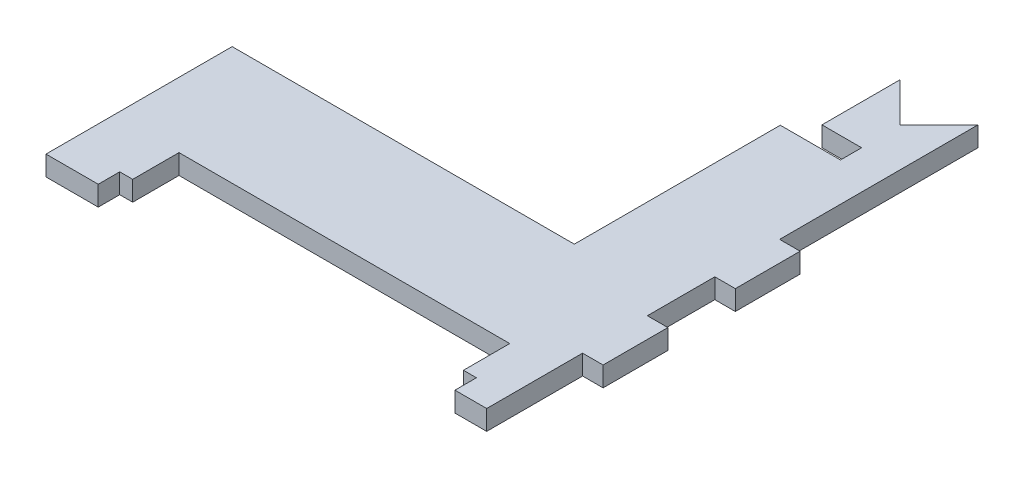
ISO-10303-21;
HEADER;
FILE_DESCRIPTION(('STEP AP214'),'2;1');
FILE_NAME('part.step','',(''),(''),'','','');
FILE_SCHEMA(('AUTOMOTIVE_DESIGN { 1 0 10303 214 1 1 1 1 }'));
ENDSEC;
DATA;
#1=APPLICATION_CONTEXT('core data for automotive mechanical design processes');
#2=APPLICATION_PROTOCOL_DEFINITION('international standard','automotive_design',2000,#1);
#3=PRODUCT_CONTEXT('',#1,'mechanical');
#4=PRODUCT('Part','Part','',(#3));
#5=PRODUCT_RELATED_PRODUCT_CATEGORY('part','',(#4));
#6=PRODUCT_DEFINITION_FORMATION('','',#4);
#7=PRODUCT_DEFINITION_CONTEXT('part definition',#1,'design');
#8=PRODUCT_DEFINITION('design','',#6,#7);
#9=PRODUCT_DEFINITION_SHAPE('','',#8);
#10=(LENGTH_UNIT() NAMED_UNIT(*) SI_UNIT(.MILLI.,.METRE.));
#11=(NAMED_UNIT(*) PLANE_ANGLE_UNIT() SI_UNIT($,.RADIAN.));
#12=(NAMED_UNIT(*) SI_UNIT($,.STERADIAN.) SOLID_ANGLE_UNIT());
#13=UNCERTAINTY_MEASURE_WITH_UNIT(LENGTH_MEASURE(1.E-05),#10,'distance_accuracy_value','');
#14=(GEOMETRIC_REPRESENTATION_CONTEXT(3) GLOBAL_UNCERTAINTY_ASSIGNED_CONTEXT((#13)) GLOBAL_UNIT_ASSIGNED_CONTEXT((#10,
#11,#12)) REPRESENTATION_CONTEXT('',''));
#15=CARTESIAN_POINT('',(0.,0.,0.));
#16=DIRECTION('',(0.,0.,1.));
#17=DIRECTION('',(1.,0.,0.));
#18=AXIS2_PLACEMENT_3D('',#15,#16,#17);
#19=CARTESIAN_POINT('',(0.,3.00000000000003,0.));
#20=DIRECTION('',(0.,1.,0.));
#21=DIRECTION('',(0.,0.,1.));
#22=AXIS2_PLACEMENT_3D('',#19,#20,#21);
#23=PLANE('',#22);
#24=DIRECTION('',(0.,0.,1.));
#25=VECTOR('',#24,1.);
#26=CARTESIAN_POINT('',(31.7722171016875,3.00000000000003,-15.1));
#27=LINE('',#26,#25);
#28=CARTESIAN_POINT('',(31.7722171016875,3.00000000000003,-15.1));
#29=VERTEX_POINT('',#28);
#30=CARTESIAN_POINT('',(31.7722171016875,3.00000000000003,-0.600000000000017));
#31=VERTEX_POINT('',#30);
#32=EDGE_CURVE('E220',#29,#31,#27,.T.);
#33=ORIENTED_EDGE('',*,*,#32,.F.);
#34=DIRECTION('',(-1.,0.,0.));
#35=VECTOR('',#34,1.);
#36=CARTESIAN_POINT('',(34.9722171016875,3.00000000000003,-15.1));
#37=LINE('',#36,#35);
#38=CARTESIAN_POINT('',(34.8722171016875,3.00000000000003,-15.1));
#39=VERTEX_POINT('',#38);
#40=EDGE_CURVE('E211',#39,#29,#37,.T.);
#41=ORIENTED_EDGE('',*,*,#40,.F.);
#42=DIRECTION('',(0.,0.,-1.));
#43=VECTOR('',#42,1.);
#44=CARTESIAN_POINT('',(34.8722171016875,3.00000000000003,0.));
#45=LINE('',#44,#43);
#46=CARTESIAN_POINT('',(34.8722171016875,3.00000000000003,-24.9));
#47=VERTEX_POINT('',#46);
#48=EDGE_CURVE('E367',#39,#47,#45,.T.);
#49=ORIENTED_EDGE('',*,*,#48,.T.);
#50=DIRECTION('',(1.,0.,0.));
#51=VECTOR('',#50,1.);
#52=CARTESIAN_POINT('',(31.7722171016875,3.00000000000003,-24.9));
#53=LINE('',#52,#51);
#54=CARTESIAN_POINT('',(31.7722171016875,3.00000000000003,-24.9));
#55=VERTEX_POINT('',#54);
#56=EDGE_CURVE('E329',#55,#47,#53,.T.);
#57=ORIENTED_EDGE('',*,*,#56,.F.);
#58=DIRECTION('',(0.,0.,1.));
#59=VECTOR('',#58,1.);
#60=CARTESIAN_POINT('',(31.7722171016875,3.00000000000003,-35.1));
#61=LINE('',#60,#59);
#62=CARTESIAN_POINT('',(31.7722171016875,3.00000000000003,-35.1));
#63=VERTEX_POINT('',#62);
#64=EDGE_CURVE('E326',#63,#55,#61,.T.);
#65=ORIENTED_EDGE('',*,*,#64,.F.);
#66=DIRECTION('',(-1.,0.,0.));
#67=VECTOR('',#66,1.);
#68=CARTESIAN_POINT('',(34.9722171016875,3.00000000000003,-35.1));
#69=LINE('',#68,#67);
#70=CARTESIAN_POINT('',(34.8722171016875,3.00000000000003,-35.1));
#71=VERTEX_POINT('',#70);
#72=EDGE_CURVE('E324',#71,#63,#69,.T.);
#73=ORIENTED_EDGE('',*,*,#72,.F.);
#74=CARTESIAN_POINT('',(34.8722171016875,3.00000000000003,-44.9));
#75=VERTEX_POINT('',#74);
#76=EDGE_CURVE('E365',#71,#75,#45,.T.);
#77=ORIENTED_EDGE('',*,*,#76,.T.);
#78=DIRECTION('',(1.,0.,0.));
#79=VECTOR('',#78,1.);
#80=CARTESIAN_POINT('',(31.7722171016874,3.00000000000003,-44.9));
#81=LINE('',#80,#79);
#82=CARTESIAN_POINT('',(31.7722171016874,3.00000000000003,-44.9));
#83=VERTEX_POINT('',#82);
#84=EDGE_CURVE('E349',#83,#75,#81,.T.);
#85=ORIENTED_EDGE('',*,*,#84,.F.);
#86=DIRECTION('',(0.,0.,1.));
#87=VECTOR('',#86,1.);
#88=CARTESIAN_POINT('',(31.7722171016874,3.00000000000003,-75.1));
#89=LINE('',#88,#87);
#90=CARTESIAN_POINT('',(31.7722171016874,3.00000000000003,-74.9));
#91=VERTEX_POINT('',#90);
#92=EDGE_CURVE('E347',#91,#83,#89,.T.);
#93=ORIENTED_EDGE('',*,*,#92,.F.);
#94=DIRECTION('',(-0.707106781186545,0.,0.70710678118655));
#95=VECTOR('',#94,1.);
#96=CARTESIAN_POINT('',(31.8722171016874,3.00000000000003,-75.));
#97=LINE('',#96,#95);
#98=CARTESIAN_POINT('',(25.8722171016874,3.00000000000003,-69.));
#99=VERTEX_POINT('',#98);
#100=EDGE_CURVE('E369',#91,#99,#97,.T.);
#101=ORIENTED_EDGE('',*,*,#100,.T.);
#102=DIRECTION('',(-0.707106781186545,0.,-0.70710678118655));
#103=VECTOR('',#102,1.);
#104=CARTESIAN_POINT('',(25.8722171016874,3.00000000000003,-69.));
#105=LINE('',#104,#103);
#106=CARTESIAN_POINT('',(19.9722171016874,3.00000000000003,-74.9));
#107=VERTEX_POINT('',#106);
#108=EDGE_CURVE('E371',#99,#107,#105,.T.);
#109=ORIENTED_EDGE('',*,*,#108,.T.);
#110=DIRECTION('',(0.,0.,-1.));
#111=VECTOR('',#110,1.);
#112=CARTESIAN_POINT('',(19.9722171016874,3.00000000000003,-63.1000000000001));
#113=LINE('',#112,#111);
#114=CARTESIAN_POINT('',(19.9722171016874,3.00000000000003,-63.1000000000001));
#115=VERTEX_POINT('',#114);
#116=EDGE_CURVE('E303',#115,#107,#113,.T.);
#117=ORIENTED_EDGE('',*,*,#116,.F.);
#118=DIRECTION('',(-1.,0.,0.));
#119=VECTOR('',#118,1.);
#120=CARTESIAN_POINT('',(25.9722171016874,3.00000000000003,-63.1000000000001));
#121=LINE('',#120,#119);
#122=CARTESIAN_POINT('',(25.9722171016874,3.00000000000003,-63.1000000000001));
#123=VERTEX_POINT('',#122);
#124=EDGE_CURVE('E301',#123,#115,#121,.T.);
#125=ORIENTED_EDGE('',*,*,#124,.F.);
#126=DIRECTION('',(0.,0.,-1.));
#127=VECTOR('',#126,1.);
#128=CARTESIAN_POINT('',(25.9722171016874,3.00000000000003,-59.9));
#129=LINE('',#128,#127);
#130=CARTESIAN_POINT('',(25.9722171016874,3.00000000000003,-59.9));
#131=VERTEX_POINT('',#130);
#132=EDGE_CURVE('E299',#131,#123,#129,.T.);
#133=ORIENTED_EDGE('',*,*,#132,.F.);
#134=DIRECTION('',(1.,0.,0.));
#135=VECTOR('',#134,1.);
#136=CARTESIAN_POINT('',(16.7722171016874,3.00000000000003,-59.9));
#137=LINE('',#136,#135);
#138=CARTESIAN_POINT('',(16.8722171016874,3.00000000000003,-59.9));
#139=VERTEX_POINT('',#138);
#140=EDGE_CURVE('E305',#139,#131,#137,.T.);
#141=ORIENTED_EDGE('',*,*,#140,.F.);
#142=DIRECTION('',(0.,0.,1.));
#143=VECTOR('',#142,1.);
#144=CARTESIAN_POINT('',(16.8722171016874,3.00000000000003,-75.));
#145=LINE('',#144,#143);
#146=CARTESIAN_POINT('',(16.8722171016874,3.00000000000003,-28.7500000000001));
#147=VERTEX_POINT('',#146);
#148=EDGE_CURVE('E374',#139,#147,#145,.T.);
#149=ORIENTED_EDGE('',*,*,#148,.T.);
#150=DIRECTION('',(-1.,0.,0.));
#151=VECTOR('',#150,1.);
#152=CARTESIAN_POINT('',(16.8722171016874,3.00000000000003,-28.7500000000001));
#153=LINE('',#152,#151);
#154=CARTESIAN_POINT('',(-34.8722171016874,3.00000000000003,-28.7500000000001));
#155=VERTEX_POINT('',#154);
#156=EDGE_CURVE('E376',#147,#155,#153,.T.);
#157=ORIENTED_EDGE('',*,*,#156,.T.);
#158=DIRECTION('',(0.,0.,1.));
#159=VECTOR('',#158,1.);
#160=CARTESIAN_POINT('',(-34.8722171016874,3.00000000000003,-28.7500000000001));
#161=LINE('',#160,#159);
#162=CARTESIAN_POINT('',(-34.8722171016874,3.00000000000003,-0.600000000000017));
#163=VERTEX_POINT('',#162);
#164=EDGE_CURVE('E362',#155,#163,#161,.T.);
#165=ORIENTED_EDGE('',*,*,#164,.T.);
#166=DIRECTION('',(-1.,0.,0.));
#167=VECTOR('',#166,1.);
#168=CARTESIAN_POINT('',(-26.9722171016875,3.00000000000003,-0.60000000000001));
#169=LINE('',#168,#167);
#170=CARTESIAN_POINT('',(-26.9722171016875,3.00000000000003,-0.60000000000001));
#171=VERTEX_POINT('',#170);
#172=EDGE_CURVE('E48',#171,#163,#169,.T.);
#173=ORIENTED_EDGE('',*,*,#172,.F.);
#174=DIRECTION('',(0.,0.,1.));
#175=VECTOR('',#174,1.);
#176=CARTESIAN_POINT('',(-26.9722171016875,3.00000000000003,-3.85000000000004));
#177=LINE('',#176,#175);
#178=CARTESIAN_POINT('',(-26.9722171016875,3.00000000000003,-3.85000000000004));
#179=VERTEX_POINT('',#178);
#180=EDGE_CURVE('E250',#179,#171,#177,.T.);
#181=ORIENTED_EDGE('',*,*,#180,.F.);
#182=DIRECTION('',(-1.,0.,0.));
#183=VECTOR('',#182,1.);
#184=CARTESIAN_POINT('',(-25.0087265012053,3.00000000000003,-3.85000000000004));
#185=LINE('',#184,#183);
#186=CARTESIAN_POINT('',(-25.0087265012053,3.00000000000003,-3.85000000000004));
#187=VERTEX_POINT('',#186);
#188=EDGE_CURVE('E248',#187,#179,#185,.T.);
#189=ORIENTED_EDGE('',*,*,#188,.F.);
#190=DIRECTION('',(0.,0.,1.));
#191=VECTOR('',#190,1.);
#192=CARTESIAN_POINT('',(-25.0087265012053,3.00000000000003,-10.85));
#193=LINE('',#192,#191);
#194=CARTESIAN_POINT('',(-25.0087265012053,3.00000000000003,-10.85));
#195=VERTEX_POINT('',#194);
#196=EDGE_CURVE('E246',#195,#187,#193,.T.);
#197=ORIENTED_EDGE('',*,*,#196,.F.);
#198=DIRECTION('',(-1.,0.,0.));
#199=VECTOR('',#198,1.);
#200=CARTESIAN_POINT('',(25.0087265012053,3.00000000000003,-10.85));
#201=LINE('',#200,#199);
#202=CARTESIAN_POINT('',(25.0087265012053,3.00000000000003,-10.85));
#203=VERTEX_POINT('',#202);
#204=EDGE_CURVE('E244',#203,#195,#201,.T.);
#205=ORIENTED_EDGE('',*,*,#204,.F.);
#206=DIRECTION('',(0.,0.,-1.));
#207=VECTOR('',#206,1.);
#208=CARTESIAN_POINT('',(25.0087265012053,3.00000000000003,-3.85000000000004));
#209=LINE('',#208,#207);
#210=CARTESIAN_POINT('',(25.0087265012053,3.00000000000003,-3.85000000000004));
#211=VERTEX_POINT('',#210);
#212=EDGE_CURVE('E242',#211,#203,#209,.T.);
#213=ORIENTED_EDGE('',*,*,#212,.F.);
#214=DIRECTION('',(-1.,0.,0.));
#215=VECTOR('',#214,1.);
#216=CARTESIAN_POINT('',(26.9722171016875,3.00000000000003,-3.85000000000004));
#217=LINE('',#216,#215);
#218=CARTESIAN_POINT('',(26.9722171016875,3.00000000000003,-3.85000000000004));
#219=VERTEX_POINT('',#218);
#220=EDGE_CURVE('E240',#219,#211,#217,.T.);
#221=ORIENTED_EDGE('',*,*,#220,.F.);
#222=DIRECTION('',(0.,0.,-1.));
#223=VECTOR('',#222,1.);
#224=CARTESIAN_POINT('',(26.9722171016875,3.00000000000003,-0.600000000000017));
#225=LINE('',#224,#223);
#226=CARTESIAN_POINT('',(26.9722171016875,3.00000000000003,-0.600000000000017));
#227=VERTEX_POINT('',#226);
#228=EDGE_CURVE('E236',#227,#219,#225,.T.);
#229=ORIENTED_EDGE('',*,*,#228,.F.);
#230=DIRECTION('',(-1.,0.,0.));
#231=VECTOR('',#230,1.);
#232=CARTESIAN_POINT('',(31.7722171016875,3.00000000000003,-0.600000000000017));
#233=LINE('',#232,#231);
#234=EDGE_CURVE('E234',#31,#227,#233,.T.);
#235=ORIENTED_EDGE('',*,*,#234,.F.);
#236=EDGE_LOOP('',(#33,#41,#49,#57,#65,#73,#77,#85,#93,#101,#109,#117,#125,#133,#141,#149,#157,
#165,#173,#181,#189,#197,#205,#213,#221,#229,#235));
#237=FACE_BOUND('',#236,.T.);
#238=ADVANCED_FACE('F33',(#237),#23,.T.);
#239=CARTESIAN_POINT('',(0.,0.,0.));
#240=DIRECTION('',(0.,1.,0.));
#241=DIRECTION('',(0.,0.,1.));
#242=AXIS2_PLACEMENT_3D('',#239,#240,#241);
#243=PLANE('',#242);
#244=DIRECTION('',(-1.,0.,0.));
#245=VECTOR('',#244,1.);
#246=CARTESIAN_POINT('',(34.9722171016875,0.,-15.1));
#247=LINE('',#246,#245);
#248=CARTESIAN_POINT('',(34.8722171016875,0.,-15.1));
#249=VERTEX_POINT('',#248);
#250=CARTESIAN_POINT('',(31.7722171016875,0.,-15.1));
#251=VERTEX_POINT('',#250);
#252=EDGE_CURVE('E254',#249,#251,#247,.T.);
#253=ORIENTED_EDGE('',*,*,#252,.T.);
#254=DIRECTION('',(0.,0.,1.));
#255=VECTOR('',#254,1.);
#256=CARTESIAN_POINT('',(31.7722171016875,0.,-15.1));
#257=LINE('',#256,#255);
#258=CARTESIAN_POINT('',(31.7722171016875,0.,-0.600000000000017));
#259=VERTEX_POINT('',#258);
#260=EDGE_CURVE('E227',#251,#259,#257,.T.);
#261=ORIENTED_EDGE('',*,*,#260,.T.);
#262=DIRECTION('',(-1.,0.,0.));
#263=VECTOR('',#262,1.);
#264=CARTESIAN_POINT('',(31.7722171016875,0.,-0.600000000000017));
#265=LINE('',#264,#263);
#266=CARTESIAN_POINT('',(26.9722171016875,0.,-0.600000000000017));
#267=VERTEX_POINT('',#266);
#268=EDGE_CURVE('E257',#259,#267,#265,.T.);
#269=ORIENTED_EDGE('',*,*,#268,.T.);
#270=DIRECTION('',(0.,0.,-1.));
#271=VECTOR('',#270,1.);
#272=CARTESIAN_POINT('',(26.9722171016875,0.,-0.600000000000017));
#273=LINE('',#272,#271);
#274=CARTESIAN_POINT('',(26.9722171016875,0.,-3.85000000000004));
#275=VERTEX_POINT('',#274);
#276=EDGE_CURVE('E260',#267,#275,#273,.T.);
#277=ORIENTED_EDGE('',*,*,#276,.T.);
#278=DIRECTION('',(-1.,0.,0.));
#279=VECTOR('',#278,1.);
#280=CARTESIAN_POINT('',(26.9722171016875,0.,-3.85000000000004));
#281=LINE('',#280,#279);
#282=CARTESIAN_POINT('',(25.0087265012053,0.,-3.85000000000004));
#283=VERTEX_POINT('',#282);
#284=EDGE_CURVE('E263',#275,#283,#281,.T.);
#285=ORIENTED_EDGE('',*,*,#284,.T.);
#286=DIRECTION('',(0.,0.,-1.));
#287=VECTOR('',#286,1.);
#288=CARTESIAN_POINT('',(25.0087265012053,0.,-3.85000000000004));
#289=LINE('',#288,#287);
#290=CARTESIAN_POINT('',(25.0087265012053,0.,-10.85));
#291=VERTEX_POINT('',#290);
#292=EDGE_CURVE('E266',#283,#291,#289,.T.);
#293=ORIENTED_EDGE('',*,*,#292,.T.);
#294=DIRECTION('',(-1.,0.,0.));
#295=VECTOR('',#294,1.);
#296=CARTESIAN_POINT('',(25.0087265012053,0.,-10.85));
#297=LINE('',#296,#295);
#298=CARTESIAN_POINT('',(-25.0087265012053,0.,-10.85));
#299=VERTEX_POINT('',#298);
#300=EDGE_CURVE('E269',#291,#299,#297,.T.);
#301=ORIENTED_EDGE('',*,*,#300,.T.);
#302=DIRECTION('',(0.,0.,1.));
#303=VECTOR('',#302,1.);
#304=CARTESIAN_POINT('',(-25.0087265012053,0.,-10.85));
#305=LINE('',#304,#303);
#306=CARTESIAN_POINT('',(-25.0087265012053,0.,-3.85000000000004));
#307=VERTEX_POINT('',#306);
#308=EDGE_CURVE('E272',#299,#307,#305,.T.);
#309=ORIENTED_EDGE('',*,*,#308,.T.);
#310=DIRECTION('',(-1.,0.,0.));
#311=VECTOR('',#310,1.);
#312=CARTESIAN_POINT('',(-25.0087265012053,0.,-3.85000000000004));
#313=LINE('',#312,#311);
#314=CARTESIAN_POINT('',(-26.9722171016875,0.,-3.85000000000004));
#315=VERTEX_POINT('',#314);
#316=EDGE_CURVE('E275',#307,#315,#313,.T.);
#317=ORIENTED_EDGE('',*,*,#316,.T.);
#318=DIRECTION('',(0.,0.,1.));
#319=VECTOR('',#318,1.);
#320=CARTESIAN_POINT('',(-26.9722171016875,0.,-3.85000000000004));
#321=LINE('',#320,#319);
#322=CARTESIAN_POINT('',(-26.9722171016875,0.,-0.60000000000001));
#323=VERTEX_POINT('',#322);
#324=EDGE_CURVE('E278',#315,#323,#321,.T.);
#325=ORIENTED_EDGE('',*,*,#324,.T.);
#326=DIRECTION('',(-1.,0.,0.));
#327=VECTOR('',#326,1.);
#328=CARTESIAN_POINT('',(-26.9722171016875,0.,-0.60000000000001));
#329=LINE('',#328,#327);
#330=CARTESIAN_POINT('',(-34.8722171016874,0.,-0.60000000000001));
#331=VERTEX_POINT('',#330);
#332=EDGE_CURVE('E221',#323,#331,#329,.T.);
#333=ORIENTED_EDGE('',*,*,#332,.T.);
#334=DIRECTION('',(0.,0.,1.));
#335=VECTOR('',#334,1.);
#336=CARTESIAN_POINT('',(-34.8722171016874,0.,-28.7500000000001));
#337=LINE('',#336,#335);
#338=CARTESIAN_POINT('',(-34.8722171016874,0.,-28.7500000000001));
#339=VERTEX_POINT('',#338);
#340=EDGE_CURVE('E361',#339,#331,#337,.T.);
#341=ORIENTED_EDGE('',*,*,#340,.F.);
#342=DIRECTION('',(-1.,0.,0.));
#343=VECTOR('',#342,1.);
#344=CARTESIAN_POINT('',(16.8722171016874,0.,-28.7500000000001));
#345=LINE('',#344,#343);
#346=CARTESIAN_POINT('',(16.8722171016874,0.,-28.7500000000001));
#347=VERTEX_POINT('',#346);
#348=EDGE_CURVE('E366',#347,#339,#345,.T.);
#349=ORIENTED_EDGE('',*,*,#348,.F.);
#350=DIRECTION('',(0.,0.,1.));
#351=VECTOR('',#350,1.);
#352=CARTESIAN_POINT('',(16.8722171016874,0.,-75.));
#353=LINE('',#352,#351);
#354=CARTESIAN_POINT('',(16.8722171016874,0.,-59.9));
#355=VERTEX_POINT('',#354);
#356=EDGE_CURVE('E389',#355,#347,#353,.T.);
#357=ORIENTED_EDGE('',*,*,#356,.F.);
#358=DIRECTION('',(1.,0.,0.));
#359=VECTOR('',#358,1.);
#360=CARTESIAN_POINT('',(16.7722171016874,0.,-59.9));
#361=LINE('',#360,#359);
#362=CARTESIAN_POINT('',(25.9722171016874,0.,-59.9));
#363=VERTEX_POINT('',#362);
#364=EDGE_CURVE('E56',#355,#363,#361,.T.);
#365=ORIENTED_EDGE('',*,*,#364,.T.);
#366=DIRECTION('',(0.,0.,-1.));
#367=VECTOR('',#366,1.);
#368=CARTESIAN_POINT('',(25.9722171016874,0.,-59.9));
#369=LINE('',#368,#367);
#370=CARTESIAN_POINT('',(25.9722171016874,0.,-63.1000000000001));
#371=VERTEX_POINT('',#370);
#372=EDGE_CURVE('E229',#363,#371,#369,.T.);
#373=ORIENTED_EDGE('',*,*,#372,.T.);
#374=DIRECTION('',(-1.,0.,0.));
#375=VECTOR('',#374,1.);
#376=CARTESIAN_POINT('',(25.9722171016874,0.,-63.1000000000001));
#377=LINE('',#376,#375);
#378=CARTESIAN_POINT('',(19.9722171016874,0.,-63.1000000000001));
#379=VERTEX_POINT('',#378);
#380=EDGE_CURVE('E310',#371,#379,#377,.T.);
#381=ORIENTED_EDGE('',*,*,#380,.T.);
#382=DIRECTION('',(0.,0.,-1.));
#383=VECTOR('',#382,1.);
#384=CARTESIAN_POINT('',(19.9722171016874,0.,-63.1000000000001));
#385=LINE('',#384,#383);
#386=CARTESIAN_POINT('',(19.9722171016874,0.,-74.9));
#387=VERTEX_POINT('',#386);
#388=EDGE_CURVE('E313',#379,#387,#385,.T.);
#389=ORIENTED_EDGE('',*,*,#388,.T.);
#390=DIRECTION('',(-0.707106781186545,0.,-0.70710678118655));
#391=VECTOR('',#390,1.);
#392=CARTESIAN_POINT('',(25.8722171016874,0.,-69.));
#393=LINE('',#392,#391);
#394=CARTESIAN_POINT('',(25.8722171016874,0.,-69.));
#395=VERTEX_POINT('',#394);
#396=EDGE_CURVE('E386',#395,#387,#393,.T.);
#397=ORIENTED_EDGE('',*,*,#396,.F.);
#398=DIRECTION('',(-0.707106781186545,0.,0.70710678118655));
#399=VECTOR('',#398,1.);
#400=CARTESIAN_POINT('',(31.8722171016874,0.,-75.));
#401=LINE('',#400,#399);
#402=CARTESIAN_POINT('',(31.7722171016874,0.,-74.9));
#403=VERTEX_POINT('',#402);
#404=EDGE_CURVE('E384',#403,#395,#401,.T.);
#405=ORIENTED_EDGE('',*,*,#404,.F.);
#406=DIRECTION('',(0.,0.,-1.));
#407=VECTOR('',#406,1.);
#408=CARTESIAN_POINT('',(31.7722171016874,0.,0.));
#409=LINE('',#408,#407);
#410=CARTESIAN_POINT('',(31.7722171016874,0.,-44.9));
#411=VERTEX_POINT('',#410);
#412=EDGE_CURVE('E400',#411,#403,#409,.T.);
#413=ORIENTED_EDGE('',*,*,#412,.F.);
#414=DIRECTION('',(1.,0.,0.));
#415=VECTOR('',#414,1.);
#416=CARTESIAN_POINT('',(31.7722171016874,0.,-44.9));
#417=LINE('',#416,#415);
#418=CARTESIAN_POINT('',(34.8722171016875,0.,-44.9));
#419=VERTEX_POINT('',#418);
#420=EDGE_CURVE('E346',#411,#419,#417,.T.);
#421=ORIENTED_EDGE('',*,*,#420,.T.);
#422=DIRECTION('',(0.,0.,-1.));
#423=VECTOR('',#422,1.);
#424=CARTESIAN_POINT('',(34.8722171016875,0.,0.));
#425=LINE('',#424,#423);
#426=CARTESIAN_POINT('',(34.8722171016875,0.,-35.1));
#427=VERTEX_POINT('',#426);
#428=EDGE_CURVE('E381',#427,#419,#425,.T.);
#429=ORIENTED_EDGE('',*,*,#428,.F.);
#430=DIRECTION('',(1.,0.,0.));
#431=VECTOR('',#430,1.);
#432=CARTESIAN_POINT('',(0.,0.,-35.1));
#433=LINE('',#432,#431);
#434=CARTESIAN_POINT('',(31.7722171016875,0.,-35.1));
#435=VERTEX_POINT('',#434);
#436=EDGE_CURVE('E402',#435,#427,#433,.T.);
#437=ORIENTED_EDGE('',*,*,#436,.F.);
#438=DIRECTION('',(0.,0.,1.));
#439=VECTOR('',#438,1.);
#440=CARTESIAN_POINT('',(31.7722171016875,0.,-35.1));
#441=LINE('',#440,#439);
#442=CARTESIAN_POINT('',(31.7722171016875,0.,-24.9));
#443=VERTEX_POINT('',#442);
#444=EDGE_CURVE('E323',#435,#443,#441,.T.);
#445=ORIENTED_EDGE('',*,*,#444,.T.);
#446=DIRECTION('',(1.,0.,0.));
#447=VECTOR('',#446,1.);
#448=CARTESIAN_POINT('',(31.7722171016875,0.,-24.9));
#449=LINE('',#448,#447);
#450=CARTESIAN_POINT('',(34.8722171016875,0.,-24.9));
#451=VERTEX_POINT('',#450);
#452=EDGE_CURVE('E327',#443,#451,#449,.T.);
#453=ORIENTED_EDGE('',*,*,#452,.T.);
#454=EDGE_CURVE('E382',#249,#451,#425,.T.);
#455=ORIENTED_EDGE('',*,*,#454,.F.);
#456=EDGE_LOOP('',(#253,#261,#269,#277,#285,#293,#301,#309,#317,#325,#333,#341,#349,#357,#365,
#373,#381,#389,#397,#405,#413,#421,#429,#437,#445,#453,#455));
#457=FACE_BOUND('',#456,.T.);
#458=ADVANCED_FACE('F413',(#457),#243,.F.);
#459=CARTESIAN_POINT('',(34.8722171016875,3.00000000000003,0.));
#460=DIRECTION('',(-1.,0.,0.));
#461=DIRECTION('',(0.,0.,1.));
#462=AXIS2_PLACEMENT_3D('',#459,#460,#461);
#463=PLANE('',#462);
#464=DIRECTION('',(0.,1.,0.));
#465=VECTOR('',#464,1.);
#466=CARTESIAN_POINT('',(34.8722171016875,3.00000000000003,-15.1));
#467=LINE('',#466,#465);
#468=EDGE_CURVE('E11',#249,#39,#467,.T.);
#469=ORIENTED_EDGE('',*,*,#468,.F.);
#470=ORIENTED_EDGE('',*,*,#454,.T.);
#471=DIRECTION('',(0.,-1.,0.));
#472=VECTOR('',#471,1.);
#473=CARTESIAN_POINT('',(34.8722171016875,3.00000000000003,-24.9));
#474=LINE('',#473,#472);
#475=EDGE_CURVE('E341',#47,#451,#474,.T.);
#476=ORIENTED_EDGE('',*,*,#475,.F.);
#477=ORIENTED_EDGE('',*,*,#48,.F.);
#478=EDGE_LOOP('',(#469,#470,#476,#477));
#479=FACE_BOUND('',#478,.T.);
#480=ADVANCED_FACE('F481',(#479),#463,.F.);
#481=CARTESIAN_POINT('',(-34.8722171016874,3.00000000000003,-28.7500000000001));
#482=DIRECTION('',(1.,0.,0.));
#483=DIRECTION('',(0.,0.,-1.));
#484=AXIS2_PLACEMENT_3D('',#481,#482,#483);
#485=PLANE('',#484);
#486=DIRECTION('',(0.,-1.,0.));
#487=VECTOR('',#486,1.);
#488=CARTESIAN_POINT('',(-34.8722171016874,3.00000000000003,-0.60000000000001));
#489=LINE('',#488,#487);
#490=EDGE_CURVE('E41',#163,#331,#489,.T.);
#491=ORIENTED_EDGE('',*,*,#490,.F.);
#492=ORIENTED_EDGE('',*,*,#164,.F.);
#493=DIRECTION('',(0.,-1.,0.));
#494=VECTOR('',#493,1.);
#495=CARTESIAN_POINT('',(-34.8722171016874,3.00000000000003,-28.7500000000001));
#496=LINE('',#495,#494);
#497=EDGE_CURVE('E378',#155,#339,#496,.T.);
#498=ORIENTED_EDGE('',*,*,#497,.T.);
#499=ORIENTED_EDGE('',*,*,#340,.T.);
#500=EDGE_LOOP('',(#491,#492,#498,#499));
#501=FACE_BOUND('',#500,.T.);
#502=ADVANCED_FACE('F35',(#501),#485,.F.);
#503=CARTESIAN_POINT('',(25.8722171016874,3.00000000000003,-69.));
#504=DIRECTION('',(-0.70710678118655,0.,0.707106781186545));
#505=DIRECTION('',(0.707106781186545,0.,0.70710678118655));
#506=AXIS2_PLACEMENT_3D('',#503,#504,#505);
#507=PLANE('',#506);
#508=DIRECTION('',(0.,-1.,0.));
#509=VECTOR('',#508,1.);
#510=CARTESIAN_POINT('',(19.9722171016874,3.00000000000003,-74.9));
#511=LINE('',#510,#509);
#512=EDGE_CURVE('E406',#107,#387,#511,.T.);
#513=ORIENTED_EDGE('',*,*,#512,.F.);
#514=ORIENTED_EDGE('',*,*,#108,.F.);
#515=DIRECTION('',(0.,-1.,0.));
#516=VECTOR('',#515,1.);
#517=CARTESIAN_POINT('',(25.8722171016874,3.00000000000003,-69.));
#518=LINE('',#517,#516);
#519=EDGE_CURVE('E397',#99,#395,#518,.T.);
#520=ORIENTED_EDGE('',*,*,#519,.T.);
#521=ORIENTED_EDGE('',*,*,#396,.T.);
#522=EDGE_LOOP('',(#513,#514,#520,#521));
#523=FACE_BOUND('',#522,.T.);
#524=ADVANCED_FACE('F444',(#523),#507,.F.);
#525=CARTESIAN_POINT('',(16.8722171016874,3.00000000000003,-75.));
#526=DIRECTION('',(1.,0.,0.));
#527=DIRECTION('',(0.,0.,-1.));
#528=AXIS2_PLACEMENT_3D('',#525,#526,#527);
#529=PLANE('',#528);
#530=DIRECTION('',(0.,1.,0.));
#531=VECTOR('',#530,1.);
#532=CARTESIAN_POINT('',(16.8722171016874,3.00000000000003,-59.9));
#533=LINE('',#532,#531);
#534=EDGE_CURVE('E404',#355,#139,#533,.T.);
#535=ORIENTED_EDGE('',*,*,#534,.F.);
#536=ORIENTED_EDGE('',*,*,#356,.T.);
#537=DIRECTION('',(0.,-1.,0.));
#538=VECTOR('',#537,1.);
#539=CARTESIAN_POINT('',(16.8722171016874,3.00000000000003,-28.7500000000001));
#540=LINE('',#539,#538);
#541=EDGE_CURVE('E394',#147,#347,#540,.T.);
#542=ORIENTED_EDGE('',*,*,#541,.F.);
#543=ORIENTED_EDGE('',*,*,#148,.F.);
#544=EDGE_LOOP('',(#535,#536,#542,#543));
#545=FACE_BOUND('',#544,.T.);
#546=ADVANCED_FACE('F423',(#545),#529,.F.);
#547=DIRECTION('',(0.,1.,0.));
#548=VECTOR('',#547,1.);
#549=CARTESIAN_POINT('',(34.8722171016875,3.00000000000003,-35.1));
#550=LINE('',#549,#548);
#551=EDGE_CURVE('E344',#427,#71,#550,.T.);
#552=ORIENTED_EDGE('',*,*,#551,.F.);
#553=ORIENTED_EDGE('',*,*,#428,.T.);
#554=DIRECTION('',(0.,-1.,0.));
#555=VECTOR('',#554,1.);
#556=CARTESIAN_POINT('',(34.8722171016875,3.00000000000003,-44.9));
#557=LINE('',#556,#555);
#558=EDGE_CURVE('E356',#75,#419,#557,.T.);
#559=ORIENTED_EDGE('',*,*,#558,.F.);
#560=ORIENTED_EDGE('',*,*,#76,.F.);
#561=EDGE_LOOP('',(#552,#553,#559,#560));
#562=FACE_BOUND('',#561,.T.);
#563=ADVANCED_FACE('F465',(#562),#463,.F.);
#564=CARTESIAN_POINT('',(31.8722171016874,3.00000000000003,-75.));
#565=DIRECTION('',(0.70710678118655,0.,0.707106781186545));
#566=DIRECTION('',(0.707106781186545,0.,-0.70710678118655));
#567=AXIS2_PLACEMENT_3D('',#564,#565,#566);
#568=PLANE('',#567);
#569=DIRECTION('',(0.,1.,0.));
#570=VECTOR('',#569,1.);
#571=CARTESIAN_POINT('',(31.7722171016874,3.00000000000003,-74.9));
#572=LINE('',#571,#570);
#573=EDGE_CURVE('E359',#403,#91,#572,.T.);
#574=ORIENTED_EDGE('',*,*,#573,.F.);
#575=ORIENTED_EDGE('',*,*,#404,.T.);
#576=ORIENTED_EDGE('',*,*,#519,.F.);
#577=ORIENTED_EDGE('',*,*,#100,.F.);
#578=EDGE_LOOP('',(#574,#575,#576,#577));
#579=FACE_BOUND('',#578,.T.);
#580=ADVANCED_FACE('F450',(#579),#568,.F.);
#581=CARTESIAN_POINT('',(16.8722171016874,3.00000000000003,-28.7500000000001));
#582=DIRECTION('',(0.,0.,1.));
#583=DIRECTION('',(1.,0.,0.));
#584=AXIS2_PLACEMENT_3D('',#581,#582,#583);
#585=PLANE('',#584);
#586=ORIENTED_EDGE('',*,*,#348,.T.);
#587=ORIENTED_EDGE('',*,*,#497,.F.);
#588=ORIENTED_EDGE('',*,*,#156,.F.);
#589=ORIENTED_EDGE('',*,*,#541,.T.);
#590=EDGE_LOOP('',(#586,#587,#588,#589));
#591=FACE_BOUND('',#590,.T.);
#592=ADVANCED_FACE('F419',(#591),#585,.F.);
#593=CARTESIAN_POINT('',(31.7722171016874,3.00000000000003,-75.1));
#594=DIRECTION('',(1.,0.,0.));
#595=DIRECTION('',(0.,0.,-1.));
#596=AXIS2_PLACEMENT_3D('',#593,#594,#595);
#597=PLANE('',#596);
#598=ORIENTED_EDGE('',*,*,#573,.T.);
#599=ORIENTED_EDGE('',*,*,#92,.T.);
#600=DIRECTION('',(0.,-1.,0.));
#601=VECTOR('',#600,1.);
#602=CARTESIAN_POINT('',(31.7722171016874,3.00000000000003,-44.9));
#603=LINE('',#602,#601);
#604=EDGE_CURVE('E352',#83,#411,#603,.T.);
#605=ORIENTED_EDGE('',*,*,#604,.T.);
#606=ORIENTED_EDGE('',*,*,#412,.T.);
#607=EDGE_LOOP('',(#598,#599,#605,#606));
#608=FACE_BOUND('',#607,.T.);
#609=ADVANCED_FACE('F455',(#608),#597,.T.);
#610=CARTESIAN_POINT('',(31.7722171016874,3.00000000000003,-44.9));
#611=DIRECTION('',(0.,0.,-1.));
#612=DIRECTION('',(-1.,0.,0.));
#613=AXIS2_PLACEMENT_3D('',#610,#611,#612);
#614=PLANE('',#613);
#615=ORIENTED_EDGE('',*,*,#558,.T.);
#616=ORIENTED_EDGE('',*,*,#420,.F.);
#617=ORIENTED_EDGE('',*,*,#604,.F.);
#618=ORIENTED_EDGE('',*,*,#84,.T.);
#619=EDGE_LOOP('',(#615,#616,#617,#618));
#620=FACE_BOUND('',#619,.T.);
#621=ADVANCED_FACE('F460',(#620),#614,.T.);
#622=CARTESIAN_POINT('',(34.9722171016875,3.00000000000003,-35.1));
#623=DIRECTION('',(0.,0.,1.));
#624=DIRECTION('',(1.,0.,0.));
#625=AXIS2_PLACEMENT_3D('',#622,#623,#624);
#626=PLANE('',#625);
#627=ORIENTED_EDGE('',*,*,#551,.T.);
#628=ORIENTED_EDGE('',*,*,#72,.T.);
#629=DIRECTION('',(0.,-1.,0.));
#630=VECTOR('',#629,1.);
#631=CARTESIAN_POINT('',(31.7722171016875,3.00000000000003,-35.1));
#632=LINE('',#631,#630);
#633=EDGE_CURVE('E338',#63,#435,#632,.T.);
#634=ORIENTED_EDGE('',*,*,#633,.T.);
#635=ORIENTED_EDGE('',*,*,#436,.T.);
#636=EDGE_LOOP('',(#627,#628,#634,#635));
#637=FACE_BOUND('',#636,.T.);
#638=ADVANCED_FACE('F468',(#637),#626,.T.);
#639=CARTESIAN_POINT('',(31.7722171016875,3.00000000000003,-24.9));
#640=DIRECTION('',(0.,0.,-1.));
#641=DIRECTION('',(-1.,0.,0.));
#642=AXIS2_PLACEMENT_3D('',#639,#640,#641);
#643=PLANE('',#642);
#644=ORIENTED_EDGE('',*,*,#475,.T.);
#645=ORIENTED_EDGE('',*,*,#452,.F.);
#646=DIRECTION('',(0.,-1.,0.));
#647=VECTOR('',#646,1.);
#648=CARTESIAN_POINT('',(31.7722171016875,3.00000000000003,-24.9));
#649=LINE('',#648,#647);
#650=EDGE_CURVE('E332',#55,#443,#649,.T.);
#651=ORIENTED_EDGE('',*,*,#650,.F.);
#652=ORIENTED_EDGE('',*,*,#56,.T.);
#653=EDGE_LOOP('',(#644,#645,#651,#652));
#654=FACE_BOUND('',#653,.T.);
#655=ADVANCED_FACE('F478',(#654),#643,.T.);
#656=CARTESIAN_POINT('',(31.7722171016875,3.00000000000003,-35.1));
#657=DIRECTION('',(1.,0.,0.));
#658=DIRECTION('',(0.,0.,-1.));
#659=AXIS2_PLACEMENT_3D('',#656,#657,#658);
#660=PLANE('',#659);
#661=ORIENTED_EDGE('',*,*,#444,.F.);
#662=ORIENTED_EDGE('',*,*,#633,.F.);
#663=ORIENTED_EDGE('',*,*,#64,.T.);
#664=ORIENTED_EDGE('',*,*,#650,.T.);
#665=EDGE_LOOP('',(#661,#662,#663,#664));
#666=FACE_BOUND('',#665,.T.);
#667=ADVANCED_FACE('F473',(#666),#660,.T.);
#668=CARTESIAN_POINT('',(19.9722171016874,3.00000000000003,-63.1000000000001));
#669=DIRECTION('',(-1.,0.,0.));
#670=DIRECTION('',(0.,0.,1.));
#671=AXIS2_PLACEMENT_3D('',#668,#669,#670);
#672=PLANE('',#671);
#673=ORIENTED_EDGE('',*,*,#512,.T.);
#674=ORIENTED_EDGE('',*,*,#388,.F.);
#675=DIRECTION('',(0.,-1.,0.));
#676=VECTOR('',#675,1.);
#677=CARTESIAN_POINT('',(19.9722171016874,3.00000000000003,-63.1000000000001));
#678=LINE('',#677,#676);
#679=EDGE_CURVE('E318',#115,#379,#678,.T.);
#680=ORIENTED_EDGE('',*,*,#679,.F.);
#681=ORIENTED_EDGE('',*,*,#116,.T.);
#682=EDGE_LOOP('',(#673,#674,#680,#681));
#683=FACE_BOUND('',#682,.T.);
#684=ADVANCED_FACE('F610',(#683),#672,.T.);
#685=CARTESIAN_POINT('',(16.7722171016874,3.00000000000003,-59.9));
#686=DIRECTION('',(0.,0.,-1.));
#687=DIRECTION('',(-1.,0.,0.));
#688=AXIS2_PLACEMENT_3D('',#685,#686,#687);
#689=PLANE('',#688);
#690=ORIENTED_EDGE('',*,*,#534,.T.);
#691=ORIENTED_EDGE('',*,*,#140,.T.);
#692=DIRECTION('',(0.,-1.,0.));
#693=VECTOR('',#692,1.);
#694=CARTESIAN_POINT('',(25.9722171016874,3.00000000000003,-59.9));
#695=LINE('',#694,#693);
#696=EDGE_CURVE('E307',#131,#363,#695,.T.);
#697=ORIENTED_EDGE('',*,*,#696,.T.);
#698=ORIENTED_EDGE('',*,*,#364,.F.);
#699=EDGE_LOOP('',(#690,#691,#697,#698));
#700=FACE_BOUND('',#699,.T.);
#701=ADVANCED_FACE('F426',(#700),#689,.T.);
#702=CARTESIAN_POINT('',(25.9722171016874,3.00000000000003,-59.9));
#703=DIRECTION('',(-1.,0.,0.));
#704=DIRECTION('',(0.,0.,1.));
#705=AXIS2_PLACEMENT_3D('',#702,#703,#704);
#706=PLANE('',#705);
#707=ORIENTED_EDGE('',*,*,#372,.F.);
#708=ORIENTED_EDGE('',*,*,#696,.F.);
#709=ORIENTED_EDGE('',*,*,#132,.T.);
#710=DIRECTION('',(0.,-1.,0.));
#711=VECTOR('',#710,1.);
#712=CARTESIAN_POINT('',(25.9722171016874,3.00000000000003,-63.1000000000001));
#713=LINE('',#712,#711);
#714=EDGE_CURVE('E320',#123,#371,#713,.T.);
#715=ORIENTED_EDGE('',*,*,#714,.T.);
#716=EDGE_LOOP('',(#707,#708,#709,#715));
#717=FACE_BOUND('',#716,.T.);
#718=ADVANCED_FACE('F434',(#717),#706,.T.);
#719=CARTESIAN_POINT('',(25.9722171016874,3.00000000000003,-63.1000000000001));
#720=DIRECTION('',(0.,0.,1.));
#721=DIRECTION('',(1.,0.,0.));
#722=AXIS2_PLACEMENT_3D('',#719,#720,#721);
#723=PLANE('',#722);
#724=ORIENTED_EDGE('',*,*,#380,.F.);
#725=ORIENTED_EDGE('',*,*,#714,.F.);
#726=ORIENTED_EDGE('',*,*,#124,.T.);
#727=ORIENTED_EDGE('',*,*,#679,.T.);
#728=EDGE_LOOP('',(#724,#725,#726,#727));
#729=FACE_BOUND('',#728,.T.);
#730=ADVANCED_FACE('F436',(#729),#723,.T.);
#731=CARTESIAN_POINT('',(34.9722171016875,3.00000000000003,-15.1));
#732=DIRECTION('',(0.,0.,1.));
#733=DIRECTION('',(1.,0.,0.));
#734=AXIS2_PLACEMENT_3D('',#731,#732,#733);
#735=PLANE('',#734);
#736=ORIENTED_EDGE('',*,*,#468,.T.);
#737=ORIENTED_EDGE('',*,*,#40,.T.);
#738=DIRECTION('',(0.,-1.,0.));
#739=VECTOR('',#738,1.);
#740=CARTESIAN_POINT('',(31.7722171016875,3.00000000000003,-15.1));
#741=LINE('',#740,#739);
#742=EDGE_CURVE('E214',#29,#251,#741,.T.);
#743=ORIENTED_EDGE('',*,*,#742,.T.);
#744=ORIENTED_EDGE('',*,*,#252,.F.);
#745=EDGE_LOOP('',(#736,#737,#743,#744));
#746=FACE_BOUND('',#745,.T.);
#747=ADVANCED_FACE('F213',(#746),#735,.T.);
#748=CARTESIAN_POINT('',(-26.9722171016875,3.00000000000003,-0.60000000000001));
#749=DIRECTION('',(0.,0.,1.));
#750=DIRECTION('',(1.,0.,0.));
#751=AXIS2_PLACEMENT_3D('',#748,#749,#750);
#752=PLANE('',#751);
#753=ORIENTED_EDGE('',*,*,#490,.T.);
#754=ORIENTED_EDGE('',*,*,#332,.F.);
#755=DIRECTION('',(0.,-1.,0.));
#756=VECTOR('',#755,1.);
#757=CARTESIAN_POINT('',(-26.9722171016875,3.00000000000003,-0.60000000000001));
#758=LINE('',#757,#756);
#759=EDGE_CURVE('E253',#171,#323,#758,.T.);
#760=ORIENTED_EDGE('',*,*,#759,.F.);
#761=ORIENTED_EDGE('',*,*,#172,.T.);
#762=EDGE_LOOP('',(#753,#754,#760,#761));
#763=FACE_BOUND('',#762,.T.);
#764=ADVANCED_FACE('F408',(#763),#752,.T.);
#765=CARTESIAN_POINT('',(31.7722171016875,3.00000000000003,-15.1));
#766=DIRECTION('',(1.,0.,0.));
#767=DIRECTION('',(0.,0.,-1.));
#768=AXIS2_PLACEMENT_3D('',#765,#766,#767);
#769=PLANE('',#768);
#770=ORIENTED_EDGE('',*,*,#260,.F.);
#771=ORIENTED_EDGE('',*,*,#742,.F.);
#772=ORIENTED_EDGE('',*,*,#32,.T.);
#773=DIRECTION('',(0.,-1.,0.));
#774=VECTOR('',#773,1.);
#775=CARTESIAN_POINT('',(31.7722171016875,3.00000000000003,-0.600000000000017));
#776=LINE('',#775,#774);
#777=EDGE_CURVE('E230',#31,#259,#776,.T.);
#778=ORIENTED_EDGE('',*,*,#777,.T.);
#779=EDGE_LOOP('',(#770,#771,#772,#778));
#780=FACE_BOUND('',#779,.T.);
#781=ADVANCED_FACE('F224',(#780),#769,.T.);
#782=CARTESIAN_POINT('',(31.7722171016875,3.00000000000003,-0.600000000000017));
#783=DIRECTION('',(0.,0.,1.));
#784=DIRECTION('',(1.,0.,0.));
#785=AXIS2_PLACEMENT_3D('',#782,#783,#784);
#786=PLANE('',#785);
#787=ORIENTED_EDGE('',*,*,#268,.F.);
#788=ORIENTED_EDGE('',*,*,#777,.F.);
#789=ORIENTED_EDGE('',*,*,#234,.T.);
#790=DIRECTION('',(0.,-1.,0.));
#791=VECTOR('',#790,1.);
#792=CARTESIAN_POINT('',(26.9722171016875,3.00000000000003,-0.600000000000017));
#793=LINE('',#792,#791);
#794=EDGE_CURVE('E296',#227,#267,#793,.T.);
#795=ORIENTED_EDGE('',*,*,#794,.T.);
#796=EDGE_LOOP('',(#787,#788,#789,#795));
#797=FACE_BOUND('',#796,.T.);
#798=ADVANCED_FACE('F486',(#797),#786,.T.);
#799=CARTESIAN_POINT('',(26.9722171016875,3.00000000000003,-0.600000000000017));
#800=DIRECTION('',(-1.,0.,0.));
#801=DIRECTION('',(0.,0.,1.));
#802=AXIS2_PLACEMENT_3D('',#799,#800,#801);
#803=PLANE('',#802);
#804=ORIENTED_EDGE('',*,*,#276,.F.);
#805=ORIENTED_EDGE('',*,*,#794,.F.);
#806=ORIENTED_EDGE('',*,*,#228,.T.);
#807=DIRECTION('',(0.,-1.,0.));
#808=VECTOR('',#807,1.);
#809=CARTESIAN_POINT('',(26.9722171016875,3.00000000000003,-3.85000000000004));
#810=LINE('',#809,#808);
#811=EDGE_CURVE('E294',#219,#275,#810,.T.);
#812=ORIENTED_EDGE('',*,*,#811,.T.);
#813=EDGE_LOOP('',(#804,#805,#806,#812));
#814=FACE_BOUND('',#813,.T.);
#815=ADVANCED_FACE('F489',(#814),#803,.T.);
#816=CARTESIAN_POINT('',(26.9722171016875,3.00000000000003,-3.85000000000004));
#817=DIRECTION('',(0.,0.,1.));
#818=DIRECTION('',(1.,0.,0.));
#819=AXIS2_PLACEMENT_3D('',#816,#817,#818);
#820=PLANE('',#819);
#821=ORIENTED_EDGE('',*,*,#284,.F.);
#822=ORIENTED_EDGE('',*,*,#811,.F.);
#823=ORIENTED_EDGE('',*,*,#220,.T.);
#824=DIRECTION('',(0.,-1.,0.));
#825=VECTOR('',#824,1.);
#826=CARTESIAN_POINT('',(25.0087265012053,3.00000000000003,-3.85000000000004));
#827=LINE('',#826,#825);
#828=EDGE_CURVE('E292',#211,#283,#827,.T.);
#829=ORIENTED_EDGE('',*,*,#828,.T.);
#830=EDGE_LOOP('',(#821,#822,#823,#829));
#831=FACE_BOUND('',#830,.T.);
#832=ADVANCED_FACE('F494',(#831),#820,.T.);
#833=CARTESIAN_POINT('',(25.0087265012053,3.00000000000003,-3.85000000000004));
#834=DIRECTION('',(-1.,0.,0.));
#835=DIRECTION('',(0.,0.,1.));
#836=AXIS2_PLACEMENT_3D('',#833,#834,#835);
#837=PLANE('',#836);
#838=ORIENTED_EDGE('',*,*,#292,.F.);
#839=ORIENTED_EDGE('',*,*,#828,.F.);
#840=ORIENTED_EDGE('',*,*,#212,.T.);
#841=DIRECTION('',(0.,-1.,0.));
#842=VECTOR('',#841,1.);
#843=CARTESIAN_POINT('',(25.0087265012053,3.00000000000003,-10.85));
#844=LINE('',#843,#842);
#845=EDGE_CURVE('E290',#203,#291,#844,.T.);
#846=ORIENTED_EDGE('',*,*,#845,.T.);
#847=EDGE_LOOP('',(#838,#839,#840,#846));
#848=FACE_BOUND('',#847,.T.);
#849=ADVANCED_FACE('F499',(#848),#837,.T.);
#850=CARTESIAN_POINT('',(25.0087265012053,3.00000000000003,-10.85));
#851=DIRECTION('',(0.,0.,1.));
#852=DIRECTION('',(1.,0.,0.));
#853=AXIS2_PLACEMENT_3D('',#850,#851,#852);
#854=PLANE('',#853);
#855=ORIENTED_EDGE('',*,*,#300,.F.);
#856=ORIENTED_EDGE('',*,*,#845,.F.);
#857=ORIENTED_EDGE('',*,*,#204,.T.);
#858=DIRECTION('',(0.,-1.,0.));
#859=VECTOR('',#858,1.);
#860=CARTESIAN_POINT('',(-25.0087265012053,3.00000000000003,-10.85));
#861=LINE('',#860,#859);
#862=EDGE_CURVE('E288',#195,#299,#861,.T.);
#863=ORIENTED_EDGE('',*,*,#862,.T.);
#864=EDGE_LOOP('',(#855,#856,#857,#863));
#865=FACE_BOUND('',#864,.T.);
#866=ADVANCED_FACE('F504',(#865),#854,.T.);
#867=CARTESIAN_POINT('',(-25.0087265012053,3.00000000000003,-10.85));
#868=DIRECTION('',(1.,0.,0.));
#869=DIRECTION('',(0.,0.,-1.));
#870=AXIS2_PLACEMENT_3D('',#867,#868,#869);
#871=PLANE('',#870);
#872=ORIENTED_EDGE('',*,*,#308,.F.);
#873=ORIENTED_EDGE('',*,*,#862,.F.);
#874=ORIENTED_EDGE('',*,*,#196,.T.);
#875=DIRECTION('',(0.,-1.,0.));
#876=VECTOR('',#875,1.);
#877=CARTESIAN_POINT('',(-25.0087265012053,3.00000000000003,-3.85000000000004));
#878=LINE('',#877,#876);
#879=EDGE_CURVE('E286',#187,#307,#878,.T.);
#880=ORIENTED_EDGE('',*,*,#879,.T.);
#881=EDGE_LOOP('',(#872,#873,#874,#880));
#882=FACE_BOUND('',#881,.T.);
#883=ADVANCED_FACE('F509',(#882),#871,.T.);
#884=CARTESIAN_POINT('',(-25.0087265012053,3.00000000000003,-3.85000000000004));
#885=DIRECTION('',(0.,0.,1.));
#886=DIRECTION('',(1.,0.,0.));
#887=AXIS2_PLACEMENT_3D('',#884,#885,#886);
#888=PLANE('',#887);
#889=ORIENTED_EDGE('',*,*,#316,.F.);
#890=ORIENTED_EDGE('',*,*,#879,.F.);
#891=ORIENTED_EDGE('',*,*,#188,.T.);
#892=DIRECTION('',(0.,-1.,0.));
#893=VECTOR('',#892,1.);
#894=CARTESIAN_POINT('',(-26.9722171016875,3.00000000000003,-3.85000000000004));
#895=LINE('',#894,#893);
#896=EDGE_CURVE('E284',#179,#315,#895,.T.);
#897=ORIENTED_EDGE('',*,*,#896,.T.);
#898=EDGE_LOOP('',(#889,#890,#891,#897));
#899=FACE_BOUND('',#898,.T.);
#900=ADVANCED_FACE('F513',(#899),#888,.T.);
#901=CARTESIAN_POINT('',(-26.9722171016875,3.00000000000003,-3.85000000000004));
#902=DIRECTION('',(1.,0.,0.));
#903=DIRECTION('',(0.,0.,-1.));
#904=AXIS2_PLACEMENT_3D('',#901,#902,#903);
#905=PLANE('',#904);
#906=ORIENTED_EDGE('',*,*,#324,.F.);
#907=ORIENTED_EDGE('',*,*,#896,.F.);
#908=ORIENTED_EDGE('',*,*,#180,.T.);
#909=ORIENTED_EDGE('',*,*,#759,.T.);
#910=EDGE_LOOP('',(#906,#907,#908,#909));
#911=FACE_BOUND('',#910,.T.);
#912=ADVANCED_FACE('F518',(#911),#905,.T.);
#913=CLOSED_SHELL('',(#238,#458,#480,#502,#524,#546,#563,#580,#592,#609,#621,#638,#655,#667,
#684,#701,#718,#730,#747,#764,#781,#798,#815,#832,#849,#866,#883,#900,#912));
#914=MANIFOLD_SOLID_BREP('B2',#913);
#915=ADVANCED_BREP_SHAPE_REPRESENTATION('',(#18,#914),#14);
#916=SHAPE_DEFINITION_REPRESENTATION(#9,#915);
ENDSEC;
END-ISO-10303-21;
